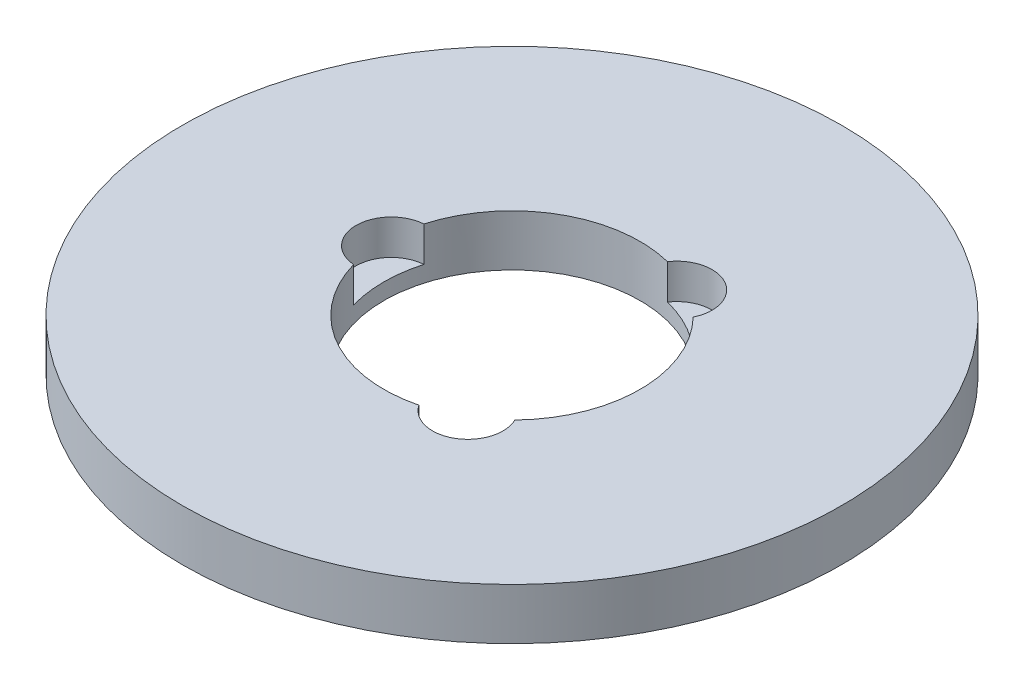
ISO-10303-21;
HEADER;
FILE_DESCRIPTION(('STEP AP214'),'2;1');
FILE_NAME('part.step','',(''),(''),'','','');
FILE_SCHEMA(('AUTOMOTIVE_DESIGN { 1 0 10303 214 1 1 1 1 }'));
ENDSEC;
DATA;
#1=APPLICATION_CONTEXT('core data for automotive mechanical design processes');
#2=APPLICATION_PROTOCOL_DEFINITION('international standard','automotive_design',2000,#1);
#3=PRODUCT_CONTEXT('',#1,'mechanical');
#4=PRODUCT('Part','Part','',(#3));
#5=PRODUCT_RELATED_PRODUCT_CATEGORY('part','',(#4));
#6=PRODUCT_DEFINITION_FORMATION('','',#4);
#7=PRODUCT_DEFINITION_CONTEXT('part definition',#1,'design');
#8=PRODUCT_DEFINITION('design','',#6,#7);
#9=PRODUCT_DEFINITION_SHAPE('','',#8);
#10=(LENGTH_UNIT() NAMED_UNIT(*) SI_UNIT(.MILLI.,.METRE.));
#11=(NAMED_UNIT(*) PLANE_ANGLE_UNIT() SI_UNIT($,.RADIAN.));
#12=(NAMED_UNIT(*) SI_UNIT($,.STERADIAN.) SOLID_ANGLE_UNIT());
#13=UNCERTAINTY_MEASURE_WITH_UNIT(LENGTH_MEASURE(1.E-05),#10,'distance_accuracy_value','');
#14=(GEOMETRIC_REPRESENTATION_CONTEXT(3) GLOBAL_UNCERTAINTY_ASSIGNED_CONTEXT((#13)) GLOBAL_UNIT_ASSIGNED_CONTEXT((#10,
#11,#12)) REPRESENTATION_CONTEXT('',''));
#15=CARTESIAN_POINT('',(0.,0.,0.));
#16=DIRECTION('',(0.,0.,1.));
#17=DIRECTION('',(1.,0.,0.));
#18=AXIS2_PLACEMENT_3D('',#15,#16,#17);
#19=CARTESIAN_POINT('',(0.,14.,0.));
#20=DIRECTION('',(0.,-1.,0.));
#21=DIRECTION('',(0.,0.,-1.));
#22=AXIS2_PLACEMENT_3D('',#19,#20,#21);
#23=CYLINDRICAL_SURFACE('',#22,90.);
#24=CARTESIAN_POINT('',(0.,14.,0.));
#25=DIRECTION('',(0.,1.,0.));
#26=DIRECTION('',(0.,0.,1.));
#27=AXIS2_PLACEMENT_3D('',#24,#25,#26);
#28=CIRCLE('',#27,90.);
#29=CARTESIAN_POINT('',(0.,14.,90.));
#30=VERTEX_POINT('',#29);
#31=EDGE_CURVE('E130',#30,#30,#28,.T.);
#32=ORIENTED_EDGE('',*,*,#31,.F.);
#33=EDGE_LOOP('',(#32));
#34=FACE_BOUND('',#33,.T.);
#35=CARTESIAN_POINT('',(0.,0.,0.));
#36=DIRECTION('',(0.,1.,0.));
#37=DIRECTION('',(0.,0.,1.));
#38=AXIS2_PLACEMENT_3D('',#35,#36,#37);
#39=CIRCLE('',#38,90.);
#40=CARTESIAN_POINT('',(0.,0.,90.));
#41=VERTEX_POINT('',#40);
#42=EDGE_CURVE('E117',#41,#41,#39,.T.);
#43=ORIENTED_EDGE('',*,*,#42,.T.);
#44=EDGE_LOOP('',(#43));
#45=FACE_BOUND('',#44,.T.);
#46=ADVANCED_FACE('F39',(#34,#45),#23,.T.);
#47=CARTESIAN_POINT('',(0.,14.,0.));
#48=DIRECTION('',(0.,1.,0.));
#49=DIRECTION('',(0.,0.,1.));
#50=AXIS2_PLACEMENT_3D('',#47,#48,#49);
#51=PLANE('',#50);
#52=CARTESIAN_POINT('',(16.480312513996,14.,28.544738598854));
#53=DIRECTION('',(0.,1.,0.));
#54=DIRECTION('',(0.866025403784436,0.,-0.500000000000004));
#55=AXIS2_PLACEMENT_3D('',#52,#53,#54);
#56=CIRCLE('',#55,9.62143939416636);
#57=CARTESIAN_POINT('',(8.51896018783823,14.,33.9474198919156));
#58=VERTEX_POINT('',#57);
#59=CARTESIAN_POINT('',(25.1398479254172,14.,24.3513458824537));
#60=VERTEX_POINT('',#59);
#61=EDGE_CURVE('E148',#58,#60,#56,.T.);
#62=ORIENTED_EDGE('',*,*,#61,.F.);
#63=CARTESIAN_POINT('',(0.,14.,0.));
#64=DIRECTION('',(0.,1.,0.));
#65=DIRECTION('',(0.,0.,1.));
#66=AXIS2_PLACEMENT_3D('',#63,#64,#65);
#67=CIRCLE('',#66,35.);
#68=CARTESIAN_POINT('',(-33.6588081132552,14.,9.59607400946181));
#69=VERTEX_POINT('',#68);
#70=EDGE_CURVE('E113',#69,#58,#67,.T.);
#71=ORIENTED_EDGE('',*,*,#70,.F.);
#72=CARTESIAN_POINT('',(-32.9606250279918,14.,0.));
#73=DIRECTION('',(0.,1.,0.));
#74=DIRECTION('',(0.,0.,1.));
#75=AXIS2_PLACEMENT_3D('',#72,#73,#74);
#76=CIRCLE('',#75,9.62143939416636);
#77=CARTESIAN_POINT('',(-33.6588081132552,14.,-9.59607400946181));
#78=VERTEX_POINT('',#77);
#79=EDGE_CURVE('E125',#78,#69,#76,.T.);
#80=ORIENTED_EDGE('',*,*,#79,.F.);
#81=CARTESIAN_POINT('',(8.51896018783776,14.,-33.9474198919157));
#82=VERTEX_POINT('',#81);
#83=EDGE_CURVE('E107',#82,#78,#67,.T.);
#84=ORIENTED_EDGE('',*,*,#83,.F.);
#85=CARTESIAN_POINT('',(16.4803125139956,14.,-28.5447385988542));
#86=DIRECTION('',(0.,1.,0.));
#87=DIRECTION('',(-0.866025403784443,0.,-0.499999999999992));
#88=AXIS2_PLACEMENT_3D('',#85,#86,#87);
#89=CIRCLE('',#88,9.62143939416636);
#90=CARTESIAN_POINT('',(25.1398479254169,14.,-24.3513458824541));
#91=VERTEX_POINT('',#90);
#92=EDGE_CURVE('E95',#91,#82,#89,.T.);
#93=ORIENTED_EDGE('',*,*,#92,.F.);
#94=EDGE_CURVE('E106',#60,#91,#67,.T.);
#95=ORIENTED_EDGE('',*,*,#94,.F.);
#96=EDGE_LOOP('',(#62,#71,#80,#84,#93,#95));
#97=FACE_BOUND('',#96,.T.);
#98=ORIENTED_EDGE('',*,*,#31,.T.);
#99=EDGE_LOOP('',(#98));
#100=FACE_BOUND('',#99,.T.);
#101=ADVANCED_FACE('F102',(#97,#100),#51,.T.);
#102=CARTESIAN_POINT('',(0.,0.,0.));
#103=DIRECTION('',(0.,1.,0.));
#104=DIRECTION('',(0.,0.,1.));
#105=AXIS2_PLACEMENT_3D('',#102,#103,#104);
#106=PLANE('',#105);
#107=CARTESIAN_POINT('',(0.,0.,0.));
#108=DIRECTION('',(0.,1.,0.));
#109=DIRECTION('',(0.,0.,1.));
#110=AXIS2_PLACEMENT_3D('',#107,#108,#109);
#111=CIRCLE('',#110,35.);
#112=CARTESIAN_POINT('',(0.,0.,35.));
#113=VERTEX_POINT('',#112);
#114=EDGE_CURVE('E118',#113,#113,#111,.T.);
#115=ORIENTED_EDGE('',*,*,#114,.T.);
#116=EDGE_LOOP('',(#115));
#117=FACE_BOUND('',#116,.T.);
#118=ORIENTED_EDGE('',*,*,#42,.F.);
#119=EDGE_LOOP('',(#118));
#120=FACE_BOUND('',#119,.T.);
#121=ADVANCED_FACE('F161',(#117,#120),#106,.F.);
#122=CARTESIAN_POINT('',(0.,14.,0.));
#123=DIRECTION('',(0.,-1.,0.));
#124=DIRECTION('',(0.,0.,-1.));
#125=AXIS2_PLACEMENT_3D('',#122,#123,#124);
#126=CYLINDRICAL_SURFACE('',#125,35.);
#127=DIRECTION('',(0.,1.,0.));
#128=VECTOR('',#127,1.);
#129=CARTESIAN_POINT('',(8.51896018783823,9.21649054583688,33.9474198919156));
#130=LINE('',#129,#128);
#131=CARTESIAN_POINT('',(8.51896018783823,4.43298109167375,33.9474198919156));
#132=VERTEX_POINT('',#131);
#133=EDGE_CURVE('E11',#132,#58,#130,.T.);
#134=ORIENTED_EDGE('',*,*,#133,.F.);
#135=CARTESIAN_POINT('',(0.,4.43298109167375,0.));
#136=DIRECTION('',(0.,1.,0.));
#137=DIRECTION('',(0.,0.,1.));
#138=AXIS2_PLACEMENT_3D('',#135,#136,#137);
#139=CIRCLE('',#138,35.);
#140=CARTESIAN_POINT('',(25.1398479254172,4.43298109167375,24.3513458824537));
#141=VERTEX_POINT('',#140);
#142=EDGE_CURVE('E100',#132,#141,#139,.T.);
#143=ORIENTED_EDGE('',*,*,#142,.T.);
#144=DIRECTION('',(0.,1.,0.));
#145=VECTOR('',#144,1.);
#146=CARTESIAN_POINT('',(25.1398479254172,9.21649054583688,24.3513458824537));
#147=LINE('',#146,#145);
#148=EDGE_CURVE('E46',#60,#141,#147,.F.);
#149=ORIENTED_EDGE('',*,*,#148,.F.);
#150=ORIENTED_EDGE('',*,*,#94,.T.);
#151=DIRECTION('',(0.,1.,0.));
#152=VECTOR('',#151,1.);
#153=CARTESIAN_POINT('',(25.1398479254169,9.21649054583688,-24.3513458824541));
#154=LINE('',#153,#152);
#155=CARTESIAN_POINT('',(25.1398479254169,4.43298109167375,-24.3513458824541));
#156=VERTEX_POINT('',#155);
#157=EDGE_CURVE('E90',#156,#91,#154,.T.);
#158=ORIENTED_EDGE('',*,*,#157,.F.);
#159=CARTESIAN_POINT('',(0.,4.43298109167375,0.));
#160=DIRECTION('',(0.,1.,0.));
#161=DIRECTION('',(0.,0.,1.));
#162=AXIS2_PLACEMENT_3D('',#159,#160,#161);
#163=CIRCLE('',#162,35.);
#164=CARTESIAN_POINT('',(8.51896018783776,4.43298109167375,-33.9474198919157));
#165=VERTEX_POINT('',#164);
#166=EDGE_CURVE('E143',#156,#165,#163,.T.);
#167=ORIENTED_EDGE('',*,*,#166,.T.);
#168=DIRECTION('',(0.,1.,0.));
#169=VECTOR('',#168,1.);
#170=CARTESIAN_POINT('',(8.51896018783776,9.21649054583688,-33.9474198919157));
#171=LINE('',#170,#169);
#172=EDGE_CURVE('E98',#82,#165,#171,.F.);
#173=ORIENTED_EDGE('',*,*,#172,.F.);
#174=ORIENTED_EDGE('',*,*,#83,.T.);
#175=DIRECTION('',(0.,1.,0.));
#176=VECTOR('',#175,1.);
#177=CARTESIAN_POINT('',(-33.6588081132552,9.21649054583688,-9.59607400946181));
#178=LINE('',#177,#176);
#179=CARTESIAN_POINT('',(-33.6588081132552,4.43298109167375,-9.59607400946181));
#180=VERTEX_POINT('',#179);
#181=EDGE_CURVE('E137',#180,#78,#178,.T.);
#182=ORIENTED_EDGE('',*,*,#181,.F.);
#183=CARTESIAN_POINT('',(0.,4.43298109167375,0.));
#184=DIRECTION('',(0.,1.,0.));
#185=DIRECTION('',(0.,0.,1.));
#186=AXIS2_PLACEMENT_3D('',#183,#184,#185);
#187=CIRCLE('',#186,35.);
#188=CARTESIAN_POINT('',(-33.6588081132552,4.43298109167375,9.59607400946181));
#189=VERTEX_POINT('',#188);
#190=EDGE_CURVE('E128',#180,#189,#187,.T.);
#191=ORIENTED_EDGE('',*,*,#190,.T.);
#192=DIRECTION('',(0.,1.,0.));
#193=VECTOR('',#192,1.);
#194=CARTESIAN_POINT('',(-33.6588081132552,9.21649054583688,9.59607400946181));
#195=LINE('',#194,#193);
#196=EDGE_CURVE('E134',#69,#189,#195,.F.);
#197=ORIENTED_EDGE('',*,*,#196,.F.);
#198=ORIENTED_EDGE('',*,*,#70,.T.);
#199=EDGE_LOOP('',(#134,#143,#149,#150,#158,#167,#173,#174,#182,#191,#197,#198));
#200=FACE_BOUND('',#199,.T.);
#201=ORIENTED_EDGE('',*,*,#114,.F.);
#202=EDGE_LOOP('',(#201));
#203=FACE_BOUND('',#202,.T.);
#204=ADVANCED_FACE('F115',(#200,#203),#126,.F.);
#205=CARTESIAN_POINT('',(-32.9606250279918,4.43298109167375,0.));
#206=DIRECTION('',(0.,1.,0.));
#207=DIRECTION('',(0.,0.,1.));
#208=AXIS2_PLACEMENT_3D('',#205,#206,#207);
#209=CYLINDRICAL_SURFACE('',#208,9.62143939416636);
#210=ORIENTED_EDGE('',*,*,#181,.T.);
#211=ORIENTED_EDGE('',*,*,#79,.T.);
#212=ORIENTED_EDGE('',*,*,#196,.T.);
#213=CARTESIAN_POINT('',(-32.9606250279918,4.43298109167375,0.));
#214=DIRECTION('',(0.,1.,0.));
#215=DIRECTION('',(0.,0.,1.));
#216=AXIS2_PLACEMENT_3D('',#213,#214,#215);
#217=CIRCLE('',#216,9.62143939416636);
#218=EDGE_CURVE('E127',#180,#189,#217,.T.);
#219=ORIENTED_EDGE('',*,*,#218,.F.);
#220=EDGE_LOOP('',(#210,#211,#212,#219));
#221=FACE_BOUND('',#220,.T.);
#222=ADVANCED_FACE('F175',(#221),#209,.F.);
#223=CARTESIAN_POINT('',(-32.9606250279918,4.43298109167375,0.));
#224=DIRECTION('',(0.,1.,0.));
#225=DIRECTION('',(0.,0.,1.));
#226=AXIS2_PLACEMENT_3D('',#223,#224,#225);
#227=PLANE('',#226);
#228=ORIENTED_EDGE('',*,*,#218,.T.);
#229=ORIENTED_EDGE('',*,*,#190,.F.);
#230=EDGE_LOOP('',(#228,#229));
#231=FACE_BOUND('',#230,.T.);
#232=ADVANCED_FACE('F176',(#231),#227,.T.);
#233=CARTESIAN_POINT('',(16.4803125139956,4.43298109167375,-28.5447385988542));
#234=DIRECTION('',(0.,1.,0.));
#235=DIRECTION('',(0.,0.,1.));
#236=AXIS2_PLACEMENT_3D('',#233,#234,#235);
#237=CYLINDRICAL_SURFACE('',#236,9.62143939416636);
#238=ORIENTED_EDGE('',*,*,#157,.T.);
#239=ORIENTED_EDGE('',*,*,#92,.T.);
#240=ORIENTED_EDGE('',*,*,#172,.T.);
#241=CARTESIAN_POINT('',(16.4803125139956,4.43298109167375,-28.5447385988542));
#242=DIRECTION('',(0.,1.,0.));
#243=DIRECTION('',(-0.866025403784443,0.,-0.499999999999992));
#244=AXIS2_PLACEMENT_3D('',#241,#242,#243);
#245=CIRCLE('',#244,9.62143939416636);
#246=EDGE_CURVE('E56',#156,#165,#245,.T.);
#247=ORIENTED_EDGE('',*,*,#246,.F.);
#248=EDGE_LOOP('',(#238,#239,#240,#247));
#249=FACE_BOUND('',#248,.T.);
#250=ADVANCED_FACE('F93',(#249),#237,.F.);
#251=CARTESIAN_POINT('',(16.4803125139956,4.43298109167375,-28.5447385988542));
#252=DIRECTION('',(0.,1.,0.));
#253=DIRECTION('',(-0.866025403784443,0.,-0.499999999999992));
#254=AXIS2_PLACEMENT_3D('',#251,#252,#253);
#255=PLANE('',#254);
#256=ORIENTED_EDGE('',*,*,#246,.T.);
#257=ORIENTED_EDGE('',*,*,#166,.F.);
#258=EDGE_LOOP('',(#256,#257));
#259=FACE_BOUND('',#258,.T.);
#260=ADVANCED_FACE('F153',(#259),#255,.T.);
#261=CARTESIAN_POINT('',(16.480312513996,4.43298109167375,28.544738598854));
#262=DIRECTION('',(0.,1.,0.));
#263=DIRECTION('',(0.,0.,1.));
#264=AXIS2_PLACEMENT_3D('',#261,#262,#263);
#265=CYLINDRICAL_SURFACE('',#264,9.62143939416636);
#266=ORIENTED_EDGE('',*,*,#133,.T.);
#267=ORIENTED_EDGE('',*,*,#61,.T.);
#268=ORIENTED_EDGE('',*,*,#148,.T.);
#269=CARTESIAN_POINT('',(16.480312513996,4.43298109167375,28.544738598854));
#270=DIRECTION('',(0.,1.,0.));
#271=DIRECTION('',(0.866025403784436,0.,-0.500000000000004));
#272=AXIS2_PLACEMENT_3D('',#269,#270,#271);
#273=CIRCLE('',#272,9.62143939416636);
#274=EDGE_CURVE('E55',#132,#141,#273,.T.);
#275=ORIENTED_EDGE('',*,*,#274,.F.);
#276=EDGE_LOOP('',(#266,#267,#268,#275));
#277=FACE_BOUND('',#276,.T.);
#278=ADVANCED_FACE('F144',(#277),#265,.F.);
#279=CARTESIAN_POINT('',(16.480312513996,4.43298109167375,28.544738598854));
#280=DIRECTION('',(0.,1.,0.));
#281=DIRECTION('',(0.866025403784436,0.,-0.500000000000004));
#282=AXIS2_PLACEMENT_3D('',#279,#280,#281);
#283=PLANE('',#282);
#284=ORIENTED_EDGE('',*,*,#274,.T.);
#285=ORIENTED_EDGE('',*,*,#142,.F.);
#286=EDGE_LOOP('',(#284,#285));
#287=FACE_BOUND('',#286,.T.);
#288=ADVANCED_FACE('F150',(#287),#283,.T.);
#289=CLOSED_SHELL('',(#46,#101,#121,#204,#222,#232,#250,#260,#278,#288));
#290=MANIFOLD_SOLID_BREP('B2',#289);
#291=ADVANCED_BREP_SHAPE_REPRESENTATION('',(#18,#290),#14);
#292=SHAPE_DEFINITION_REPRESENTATION(#9,#291);
ENDSEC;
END-ISO-10303-21;
